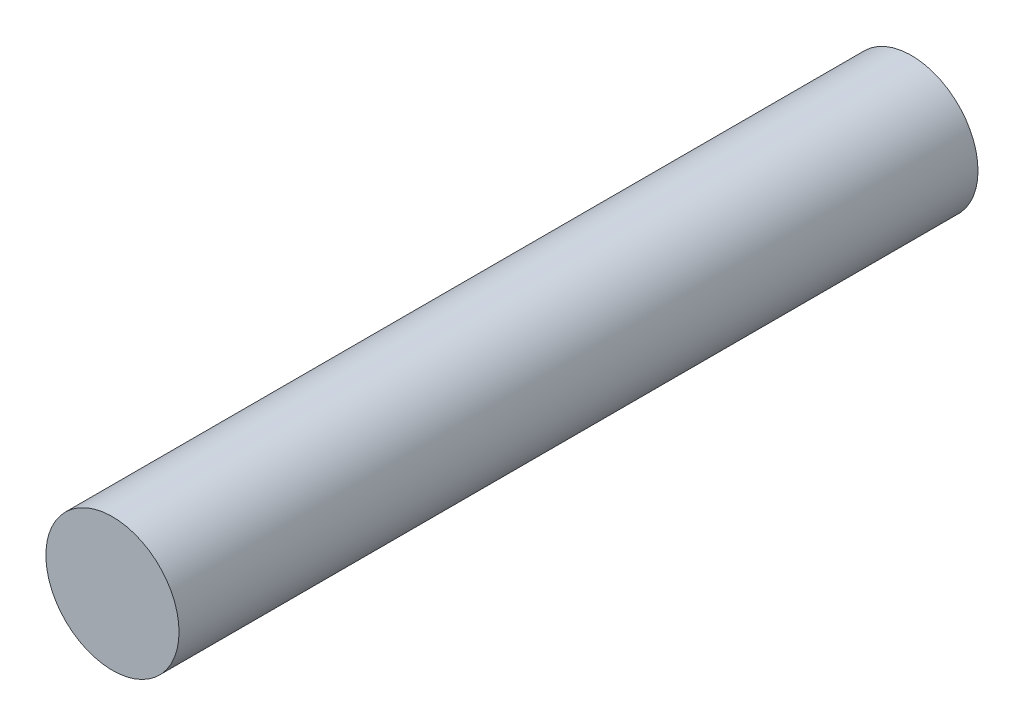
ISO-10303-21;
HEADER;
FILE_DESCRIPTION(('STEP AP214'),'2;1');
FILE_NAME('part.step','',(''),(''),'','','');
FILE_SCHEMA(('AUTOMOTIVE_DESIGN { 1 0 10303 214 1 1 1 1 }'));
ENDSEC;
DATA;
#1=APPLICATION_CONTEXT('core data for automotive mechanical design processes');
#2=APPLICATION_PROTOCOL_DEFINITION('international standard','automotive_design',2000,#1);
#3=PRODUCT_CONTEXT('',#1,'mechanical');
#4=PRODUCT('Part','Part','',(#3));
#5=PRODUCT_RELATED_PRODUCT_CATEGORY('part','',(#4));
#6=PRODUCT_DEFINITION_FORMATION('','',#4);
#7=PRODUCT_DEFINITION_CONTEXT('part definition',#1,'design');
#8=PRODUCT_DEFINITION('design','',#6,#7);
#9=PRODUCT_DEFINITION_SHAPE('','',#8);
#10=(LENGTH_UNIT() NAMED_UNIT(*) SI_UNIT(.MILLI.,.METRE.));
#11=(NAMED_UNIT(*) PLANE_ANGLE_UNIT() SI_UNIT($,.RADIAN.));
#12=(NAMED_UNIT(*) SI_UNIT($,.STERADIAN.) SOLID_ANGLE_UNIT());
#13=UNCERTAINTY_MEASURE_WITH_UNIT(LENGTH_MEASURE(1.E-05),#10,'distance_accuracy_value','');
#14=(GEOMETRIC_REPRESENTATION_CONTEXT(3) GLOBAL_UNCERTAINTY_ASSIGNED_CONTEXT((#13)) GLOBAL_UNIT_ASSIGNED_CONTEXT((#10,
#11,#12)) REPRESENTATION_CONTEXT('',''));
#15=CARTESIAN_POINT('',(0.,0.,0.));
#16=DIRECTION('',(0.,0.,1.));
#17=DIRECTION('',(1.,0.,0.));
#18=AXIS2_PLACEMENT_3D('',#15,#16,#17);
#19=CARTESIAN_POINT('',(0.,0.,45.));
#20=DIRECTION('',(0.,0.,-1.));
#21=DIRECTION('',(-1.,0.,0.));
#22=AXIS2_PLACEMENT_3D('',#19,#20,#21);
#23=CYLINDRICAL_SURFACE('',#22,3.75);
#24=CARTESIAN_POINT('',(0.,0.,45.));
#25=DIRECTION('',(0.,0.,1.));
#26=DIRECTION('',(1.,0.,0.));
#27=AXIS2_PLACEMENT_3D('',#24,#25,#26);
#28=CIRCLE('',#27,3.75);
#29=CARTESIAN_POINT('',(3.75,0.,45.));
#30=VERTEX_POINT('',#29);
#31=EDGE_CURVE('E10',#30,#30,#28,.T.);
#32=ORIENTED_EDGE('',*,*,#31,.F.);
#33=EDGE_LOOP('',(#32));
#34=FACE_BOUND('',#33,.T.);
#35=CARTESIAN_POINT('',(0.,0.,0.));
#36=DIRECTION('',(0.,0.,1.));
#37=DIRECTION('',(1.,0.,0.));
#38=AXIS2_PLACEMENT_3D('',#35,#36,#37);
#39=CIRCLE('',#38,3.75);
#40=CARTESIAN_POINT('',(3.75,0.,0.));
#41=VERTEX_POINT('',#40);
#42=EDGE_CURVE('E40',#41,#41,#39,.T.);
#43=ORIENTED_EDGE('',*,*,#42,.T.);
#44=EDGE_LOOP('',(#43));
#45=FACE_BOUND('',#44,.T.);
#46=ADVANCED_FACE('F37',(#34,#45),#23,.T.);
#47=CARTESIAN_POINT('',(0.,0.,45.));
#48=DIRECTION('',(0.,0.,1.));
#49=DIRECTION('',(1.,0.,0.));
#50=AXIS2_PLACEMENT_3D('',#47,#48,#49);
#51=PLANE('',#50);
#52=ORIENTED_EDGE('',*,*,#31,.T.);
#53=EDGE_LOOP('',(#52));
#54=FACE_BOUND('',#53,.T.);
#55=ADVANCED_FACE('F54',(#54),#51,.T.);
#56=CARTESIAN_POINT('',(0.,0.,0.));
#57=DIRECTION('',(0.,0.,1.));
#58=DIRECTION('',(1.,0.,0.));
#59=AXIS2_PLACEMENT_3D('',#56,#57,#58);
#60=PLANE('',#59);
#61=ORIENTED_EDGE('',*,*,#42,.F.);
#62=EDGE_LOOP('',(#61));
#63=FACE_BOUND('',#62,.T.);
#64=ADVANCED_FACE('F52',(#63),#60,.F.);
#65=CLOSED_SHELL('',(#46,#55,#64));
#66=MANIFOLD_SOLID_BREP('B2',#65);
#67=ADVANCED_BREP_SHAPE_REPRESENTATION('',(#18,#66),#14);
#68=SHAPE_DEFINITION_REPRESENTATION(#9,#67);
ENDSEC;
END-ISO-10303-21;
